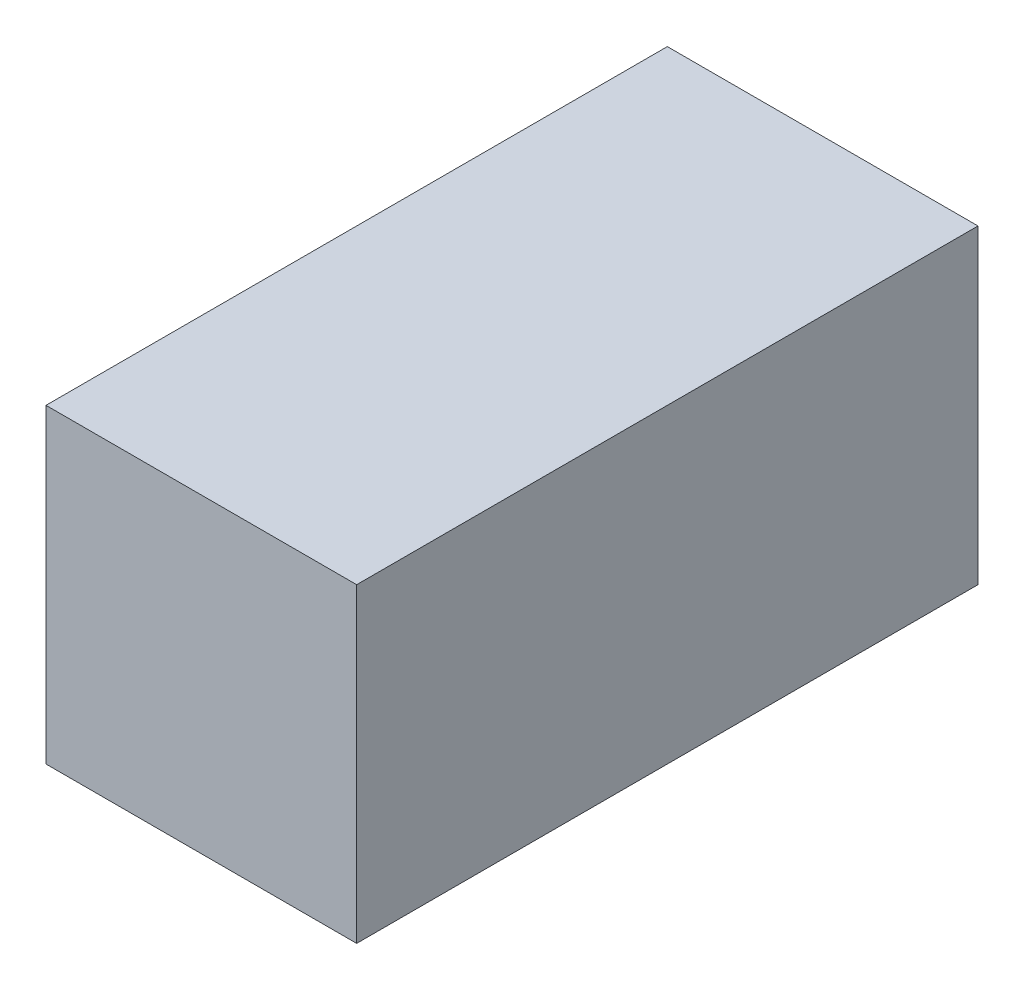
ISO-10303-21;
HEADER;
FILE_DESCRIPTION(('STEP AP214'),'2;1');
FILE_NAME('part.step','',(''),(''),'','','');
FILE_SCHEMA(('AUTOMOTIVE_DESIGN { 1 0 10303 214 1 1 1 1 }'));
ENDSEC;
DATA;
#1=APPLICATION_CONTEXT('core data for automotive mechanical design processes');
#2=APPLICATION_PROTOCOL_DEFINITION('international standard','automotive_design',2000,#1);
#3=PRODUCT_CONTEXT('',#1,'mechanical');
#4=PRODUCT('Part','Part','',(#3));
#5=PRODUCT_RELATED_PRODUCT_CATEGORY('part','',(#4));
#6=PRODUCT_DEFINITION_FORMATION('','',#4);
#7=PRODUCT_DEFINITION_CONTEXT('part definition',#1,'design');
#8=PRODUCT_DEFINITION('design','',#6,#7);
#9=PRODUCT_DEFINITION_SHAPE('','',#8);
#10=(LENGTH_UNIT() NAMED_UNIT(*) SI_UNIT(.MILLI.,.METRE.));
#11=(NAMED_UNIT(*) PLANE_ANGLE_UNIT() SI_UNIT($,.RADIAN.));
#12=(NAMED_UNIT(*) SI_UNIT($,.STERADIAN.) SOLID_ANGLE_UNIT());
#13=UNCERTAINTY_MEASURE_WITH_UNIT(LENGTH_MEASURE(1.E-05),#10,'distance_accuracy_value','');
#14=(GEOMETRIC_REPRESENTATION_CONTEXT(3) GLOBAL_UNCERTAINTY_ASSIGNED_CONTEXT((#13)) GLOBAL_UNIT_ASSIGNED_CONTEXT((#10,
#11,#12)) REPRESENTATION_CONTEXT('',''));
#15=CARTESIAN_POINT('',(0.,0.,0.));
#16=DIRECTION('',(0.,0.,1.));
#17=DIRECTION('',(1.,0.,0.));
#18=AXIS2_PLACEMENT_3D('',#15,#16,#17);
#19=CARTESIAN_POINT('',(-6.,12.,12.));
#20=DIRECTION('',(1.,0.,0.));
#21=DIRECTION('',(0.,0.,-1.));
#22=AXIS2_PLACEMENT_3D('',#19,#20,#21);
#23=PLANE('',#22);
#24=DIRECTION('',(0.,0.,1.));
#25=VECTOR('',#24,1.);
#26=CARTESIAN_POINT('',(-6.,0.,12.));
#27=LINE('',#26,#25);
#28=CARTESIAN_POINT('',(-6.,0.,-12.));
#29=VERTEX_POINT('',#28);
#30=CARTESIAN_POINT('',(-6.,0.,12.));
#31=VERTEX_POINT('',#30);
#32=EDGE_CURVE('E100',#29,#31,#27,.T.);
#33=ORIENTED_EDGE('',*,*,#32,.T.);
#34=DIRECTION('',(0.,-1.,0.));
#35=VECTOR('',#34,1.);
#36=CARTESIAN_POINT('',(-6.,12.,12.));
#37=LINE('',#36,#35);
#38=CARTESIAN_POINT('',(-6.,12.,12.));
#39=VERTEX_POINT('',#38);
#40=EDGE_CURVE('E11',#39,#31,#37,.T.);
#41=ORIENTED_EDGE('',*,*,#40,.F.);
#42=DIRECTION('',(0.,0.,1.));
#43=VECTOR('',#42,1.);
#44=CARTESIAN_POINT('',(-6.,12.,12.));
#45=LINE('',#44,#43);
#46=CARTESIAN_POINT('',(-6.,12.,-12.));
#47=VERTEX_POINT('',#46);
#48=EDGE_CURVE('E88',#47,#39,#45,.T.);
#49=ORIENTED_EDGE('',*,*,#48,.F.);
#50=DIRECTION('',(0.,-1.,0.));
#51=VECTOR('',#50,1.);
#52=CARTESIAN_POINT('',(-6.,12.,-12.));
#53=LINE('',#52,#51);
#54=EDGE_CURVE('E96',#47,#29,#53,.T.);
#55=ORIENTED_EDGE('',*,*,#54,.T.);
#56=EDGE_LOOP('',(#33,#41,#49,#55));
#57=FACE_BOUND('',#56,.T.);
#58=ADVANCED_FACE('F37',(#57),#23,.F.);
#59=CARTESIAN_POINT('',(6.,12.,12.));
#60=DIRECTION('',(0.,0.,-1.));
#61=DIRECTION('',(-1.,0.,0.));
#62=AXIS2_PLACEMENT_3D('',#59,#60,#61);
#63=PLANE('',#62);
#64=DIRECTION('',(1.,0.,0.));
#65=VECTOR('',#64,1.);
#66=CARTESIAN_POINT('',(6.,0.,12.));
#67=LINE('',#66,#65);
#68=CARTESIAN_POINT('',(6.,0.,12.));
#69=VERTEX_POINT('',#68);
#70=EDGE_CURVE('E92',#31,#69,#67,.T.);
#71=ORIENTED_EDGE('',*,*,#70,.T.);
#72=DIRECTION('',(0.,-1.,0.));
#73=VECTOR('',#72,1.);
#74=CARTESIAN_POINT('',(6.,12.,12.));
#75=LINE('',#74,#73);
#76=CARTESIAN_POINT('',(6.,12.,12.));
#77=VERTEX_POINT('',#76);
#78=EDGE_CURVE('E45',#77,#69,#75,.T.);
#79=ORIENTED_EDGE('',*,*,#78,.F.);
#80=DIRECTION('',(1.,0.,0.));
#81=VECTOR('',#80,1.);
#82=CARTESIAN_POINT('',(6.,12.,12.));
#83=LINE('',#82,#81);
#84=EDGE_CURVE('E83',#39,#77,#83,.T.);
#85=ORIENTED_EDGE('',*,*,#84,.F.);
#86=ORIENTED_EDGE('',*,*,#40,.T.);
#87=EDGE_LOOP('',(#71,#79,#85,#86));
#88=FACE_BOUND('',#87,.T.);
#89=ADVANCED_FACE('F91',(#88),#63,.F.);
#90=CARTESIAN_POINT('',(6.,12.,12.));
#91=DIRECTION('',(-1.,0.,0.));
#92=DIRECTION('',(0.,0.,1.));
#93=AXIS2_PLACEMENT_3D('',#90,#91,#92);
#94=PLANE('',#93);
#95=DIRECTION('',(0.,0.,-1.));
#96=VECTOR('',#95,1.);
#97=CARTESIAN_POINT('',(6.,0.,12.));
#98=LINE('',#97,#96);
#99=CARTESIAN_POINT('',(6.,0.,-12.));
#100=VERTEX_POINT('',#99);
#101=EDGE_CURVE('E70',#69,#100,#98,.T.);
#102=ORIENTED_EDGE('',*,*,#101,.T.);
#103=DIRECTION('',(0.,-1.,0.));
#104=VECTOR('',#103,1.);
#105=CARTESIAN_POINT('',(6.,12.,-12.));
#106=LINE('',#105,#104);
#107=CARTESIAN_POINT('',(6.,12.,-12.));
#108=VERTEX_POINT('',#107);
#109=EDGE_CURVE('E93',#108,#100,#106,.T.);
#110=ORIENTED_EDGE('',*,*,#109,.F.);
#111=DIRECTION('',(0.,0.,-1.));
#112=VECTOR('',#111,1.);
#113=CARTESIAN_POINT('',(6.,12.,12.));
#114=LINE('',#113,#112);
#115=EDGE_CURVE('E86',#77,#108,#114,.T.);
#116=ORIENTED_EDGE('',*,*,#115,.F.);
#117=ORIENTED_EDGE('',*,*,#78,.T.);
#118=EDGE_LOOP('',(#102,#110,#116,#117));
#119=FACE_BOUND('',#118,.T.);
#120=ADVANCED_FACE('F94',(#119),#94,.F.);
#121=CARTESIAN_POINT('',(6.,12.,-12.));
#122=DIRECTION('',(0.,0.,1.));
#123=DIRECTION('',(1.,0.,0.));
#124=AXIS2_PLACEMENT_3D('',#121,#122,#123);
#125=PLANE('',#124);
#126=DIRECTION('',(-1.,0.,0.));
#127=VECTOR('',#126,1.);
#128=CARTESIAN_POINT('',(6.,0.,-12.));
#129=LINE('',#128,#127);
#130=EDGE_CURVE('E76',#100,#29,#129,.T.);
#131=ORIENTED_EDGE('',*,*,#130,.T.);
#132=ORIENTED_EDGE('',*,*,#54,.F.);
#133=DIRECTION('',(-1.,0.,0.));
#134=VECTOR('',#133,1.);
#135=CARTESIAN_POINT('',(6.,12.,-12.));
#136=LINE('',#135,#134);
#137=EDGE_CURVE('E53',#108,#47,#136,.T.);
#138=ORIENTED_EDGE('',*,*,#137,.F.);
#139=ORIENTED_EDGE('',*,*,#109,.T.);
#140=EDGE_LOOP('',(#131,#132,#138,#139));
#141=FACE_BOUND('',#140,.T.);
#142=ADVANCED_FACE('F107',(#141),#125,.F.);
#143=CARTESIAN_POINT('',(0.,12.,0.));
#144=DIRECTION('',(0.,1.,0.));
#145=DIRECTION('',(0.,0.,1.));
#146=AXIS2_PLACEMENT_3D('',#143,#144,#145);
#147=PLANE('',#146);
#148=ORIENTED_EDGE('',*,*,#48,.T.);
#149=ORIENTED_EDGE('',*,*,#84,.T.);
#150=ORIENTED_EDGE('',*,*,#115,.T.);
#151=ORIENTED_EDGE('',*,*,#137,.T.);
#152=EDGE_LOOP('',(#148,#149,#150,#151));
#153=FACE_BOUND('',#152,.T.);
#154=ADVANCED_FACE('F84',(#153),#147,.T.);
#155=CARTESIAN_POINT('',(0.,0.,0.));
#156=DIRECTION('',(0.,1.,0.));
#157=DIRECTION('',(0.,0.,1.));
#158=AXIS2_PLACEMENT_3D('',#155,#156,#157);
#159=PLANE('',#158);
#160=ORIENTED_EDGE('',*,*,#32,.F.);
#161=ORIENTED_EDGE('',*,*,#130,.F.);
#162=ORIENTED_EDGE('',*,*,#101,.F.);
#163=ORIENTED_EDGE('',*,*,#70,.F.);
#164=EDGE_LOOP('',(#160,#161,#162,#163));
#165=FACE_BOUND('',#164,.T.);
#166=ADVANCED_FACE('F110',(#165),#159,.F.);
#167=CLOSED_SHELL('',(#58,#89,#120,#142,#154,#166));
#168=MANIFOLD_SOLID_BREP('B2',#167);
#169=ADVANCED_BREP_SHAPE_REPRESENTATION('',(#18,#168),#14);
#170=SHAPE_DEFINITION_REPRESENTATION(#9,#169);
ENDSEC;
END-ISO-10303-21;
